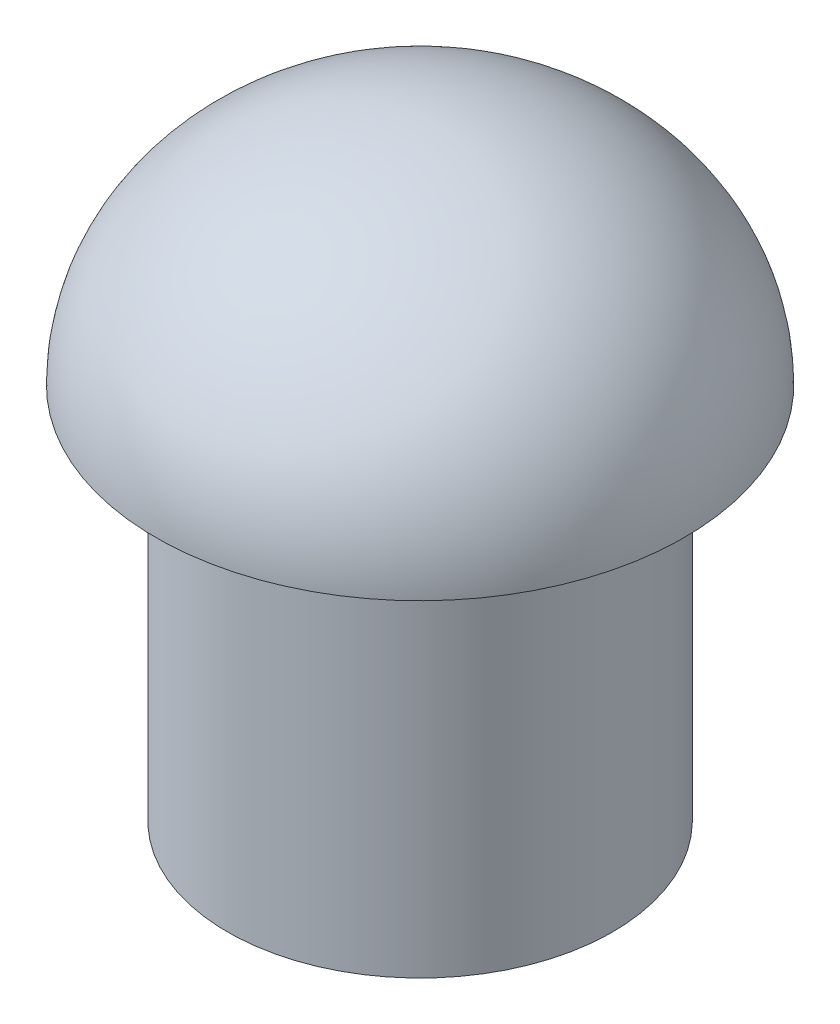
ISO-10303-21;
HEADER;
FILE_DESCRIPTION(('STEP AP214'),'2;1');
FILE_NAME('part.step','',(''),(''),'','','');
FILE_SCHEMA(('AUTOMOTIVE_DESIGN { 1 0 10303 214 1 1 1 1 }'));
ENDSEC;
DATA;
#1=APPLICATION_CONTEXT('core data for automotive mechanical design processes');
#2=APPLICATION_PROTOCOL_DEFINITION('international standard','automotive_design',2000,#1);
#3=PRODUCT_CONTEXT('',#1,'mechanical');
#4=PRODUCT('Part','Part','',(#3));
#5=PRODUCT_RELATED_PRODUCT_CATEGORY('part','',(#4));
#6=PRODUCT_DEFINITION_FORMATION('','',#4);
#7=PRODUCT_DEFINITION_CONTEXT('part definition',#1,'design');
#8=PRODUCT_DEFINITION('design','',#6,#7);
#9=PRODUCT_DEFINITION_SHAPE('','',#8);
#10=(LENGTH_UNIT() NAMED_UNIT(*) SI_UNIT(.MILLI.,.METRE.));
#11=(NAMED_UNIT(*) PLANE_ANGLE_UNIT() SI_UNIT($,.RADIAN.));
#12=(NAMED_UNIT(*) SI_UNIT($,.STERADIAN.) SOLID_ANGLE_UNIT());
#13=UNCERTAINTY_MEASURE_WITH_UNIT(LENGTH_MEASURE(1.E-05),#10,'distance_accuracy_value','');
#14=(GEOMETRIC_REPRESENTATION_CONTEXT(3) GLOBAL_UNCERTAINTY_ASSIGNED_CONTEXT((#13)) GLOBAL_UNIT_ASSIGNED_CONTEXT((#10,
#11,#12)) REPRESENTATION_CONTEXT('',''));
#15=CARTESIAN_POINT('',(0.,0.,0.));
#16=DIRECTION('',(0.,0.,1.));
#17=DIRECTION('',(1.,0.,0.));
#18=AXIS2_PLACEMENT_3D('',#15,#16,#17);
#19=CARTESIAN_POINT('',(0.,0.,0.));
#20=DIRECTION('',(0.,-1.,0.));
#21=DIRECTION('',(0.,0.,-1.));
#22=AXIS2_PLACEMENT_3D('',#19,#20,#21);
#23=PLANE('',#22);
#24=CARTESIAN_POINT('',(0.,0.,0.));
#25=DIRECTION('',(0.,-1.,0.));
#26=DIRECTION('',(0.,0.,-1.));
#27=AXIS2_PLACEMENT_3D('',#24,#25,#26);
#28=CIRCLE('',#27,2.55);
#29=CARTESIAN_POINT('',(0.,0.,-2.55));
#30=VERTEX_POINT('',#29);
#31=EDGE_CURVE('E116',#30,#30,#28,.T.);
#32=ORIENTED_EDGE('',*,*,#31,.F.);
#33=EDGE_LOOP('',(#32));
#34=FACE_BOUND('',#33,.T.);
#35=CARTESIAN_POINT('',(0.,0.,0.));
#36=DIRECTION('',(0.,-1.,0.));
#37=DIRECTION('',(0.,0.,-1.));
#38=AXIS2_PLACEMENT_3D('',#35,#36,#37);
#39=CIRCLE('',#38,3.5);
#40=CARTESIAN_POINT('',(0.,0.,-3.5));
#41=VERTEX_POINT('',#40);
#42=EDGE_CURVE('E11',#41,#41,#39,.T.);
#43=ORIENTED_EDGE('',*,*,#42,.T.);
#44=EDGE_LOOP('',(#43));
#45=FACE_BOUND('',#44,.T.);
#46=ADVANCED_FACE('F41',(#34,#45),#23,.T.);
#47=CARTESIAN_POINT('',(0.,0.,0.));
#48=DIRECTION('',(1.,0.,0.));
#49=DIRECTION('',(0.,0.,1.));
#50=AXIS2_PLACEMENT_3D('',#47,#48,#49);
#51=ELLIPSE('',#50,3.5,3.);
#52=TRIMMED_CURVE('',#51,(PARAMETER_VALUE(1.5707963267949)),(PARAMETER_VALUE(4.71238898038469)),
.T.,.PARAMETER.);
#53=CARTESIAN_POINT('',(0.,0.,0.));
#54=DIRECTION('',(0.,-1.,0.));
#55=AXIS1_PLACEMENT('',#53,#54);
#56=SURFACE_OF_REVOLUTION('',#52,#55);
#57=CARTESIAN_POINT('',(0.,3.,0.));
#58=VERTEX_POINT('',#57);
#59=VERTEX_LOOP('',#58);
#60=FACE_BOUND('',#59,.T.);
#61=ORIENTED_EDGE('',*,*,#42,.F.);
#62=EDGE_LOOP('',(#61));
#63=FACE_BOUND('',#62,.T.);
#64=ADVANCED_FACE('F124',(#60,#63),#56,.F.);
#65=CARTESIAN_POINT('',(0.,-5.,0.));
#66=DIRECTION('',(0.,1.,0.));
#67=DIRECTION('',(0.,0.,1.));
#68=AXIS2_PLACEMENT_3D('',#65,#66,#67);
#69=CYLINDRICAL_SURFACE('',#68,2.55);
#70=CARTESIAN_POINT('',(0.,-5.,0.));
#71=DIRECTION('',(0.,-1.,0.));
#72=DIRECTION('',(0.,0.,-1.));
#73=AXIS2_PLACEMENT_3D('',#70,#71,#72);
#74=CIRCLE('',#73,2.55);
#75=CARTESIAN_POINT('',(0.,-5.,-2.55));
#76=VERTEX_POINT('',#75);
#77=EDGE_CURVE('E48',#76,#76,#74,.T.);
#78=ORIENTED_EDGE('',*,*,#77,.F.);
#79=EDGE_LOOP('',(#78));
#80=FACE_BOUND('',#79,.T.);
#81=ORIENTED_EDGE('',*,*,#31,.T.);
#82=EDGE_LOOP('',(#81));
#83=FACE_BOUND('',#82,.T.);
#84=ADVANCED_FACE('F127',(#80,#83),#69,.T.);
#85=CARTESIAN_POINT('',(0.,-5.,0.));
#86=DIRECTION('',(0.,-1.,0.));
#87=DIRECTION('',(0.,0.,-1.));
#88=AXIS2_PLACEMENT_3D('',#85,#86,#87);
#89=PLANE('',#88);
#90=DIRECTION('',(0.,0.,1.));
#91=VECTOR('',#90,1.);
#92=CARTESIAN_POINT('',(1.55,-5.,-1.55));
#93=LINE('',#92,#91);
#94=CARTESIAN_POINT('',(1.55,-5.,-1.55));
#95=VERTEX_POINT('',#94);
#96=CARTESIAN_POINT('',(1.55,-5.,1.55));
#97=VERTEX_POINT('',#96);
#98=EDGE_CURVE('E55',#95,#97,#93,.T.);
#99=ORIENTED_EDGE('',*,*,#98,.F.);
#100=DIRECTION('',(1.,0.,0.));
#101=VECTOR('',#100,1.);
#102=CARTESIAN_POINT('',(-1.55,-5.,-1.55));
#103=LINE('',#102,#101);
#104=CARTESIAN_POINT('',(-1.55,-5.,-1.55));
#105=VERTEX_POINT('',#104);
#106=EDGE_CURVE('E101',#105,#95,#103,.T.);
#107=ORIENTED_EDGE('',*,*,#106,.F.);
#108=DIRECTION('',(0.,0.,-1.));
#109=VECTOR('',#108,1.);
#110=CARTESIAN_POINT('',(-1.55,-5.,-1.55));
#111=LINE('',#110,#109);
#112=CARTESIAN_POINT('',(-1.55,-5.,1.55));
#113=VERTEX_POINT('',#112);
#114=EDGE_CURVE('E104',#113,#105,#111,.T.);
#115=ORIENTED_EDGE('',*,*,#114,.F.);
#116=DIRECTION('',(-1.,0.,0.));
#117=VECTOR('',#116,1.);
#118=CARTESIAN_POINT('',(-1.55,-5.,1.55));
#119=LINE('',#118,#117);
#120=EDGE_CURVE('E110',#97,#113,#119,.T.);
#121=ORIENTED_EDGE('',*,*,#120,.F.);
#122=EDGE_LOOP('',(#99,#107,#115,#121));
#123=FACE_BOUND('',#122,.T.);
#124=ORIENTED_EDGE('',*,*,#77,.T.);
#125=EDGE_LOOP('',(#124));
#126=FACE_BOUND('',#125,.T.);
#127=ADVANCED_FACE('F130',(#123,#126),#89,.T.);
#128=CARTESIAN_POINT('',(1.55,-3.,-1.55));
#129=DIRECTION('',(1.,0.,0.));
#130=DIRECTION('',(0.,0.,-1.));
#131=AXIS2_PLACEMENT_3D('',#128,#129,#130);
#132=PLANE('',#131);
#133=ORIENTED_EDGE('',*,*,#98,.T.);
#134=DIRECTION('',(0.,-1.,0.));
#135=VECTOR('',#134,1.);
#136=CARTESIAN_POINT('',(1.55,-3.,1.55));
#137=LINE('',#136,#135);
#138=CARTESIAN_POINT('',(1.55,-3.,1.55));
#139=VERTEX_POINT('',#138);
#140=EDGE_CURVE('E79',#139,#97,#137,.T.);
#141=ORIENTED_EDGE('',*,*,#140,.F.);
#142=DIRECTION('',(0.,0.,1.));
#143=VECTOR('',#142,1.);
#144=CARTESIAN_POINT('',(1.55,-3.,-1.55));
#145=LINE('',#144,#143);
#146=CARTESIAN_POINT('',(1.55,-3.,-1.55));
#147=VERTEX_POINT('',#146);
#148=EDGE_CURVE('E83',#147,#139,#145,.T.);
#149=ORIENTED_EDGE('',*,*,#148,.F.);
#150=DIRECTION('',(0.,-1.,0.));
#151=VECTOR('',#150,1.);
#152=CARTESIAN_POINT('',(1.55,-3.,-1.55));
#153=LINE('',#152,#151);
#154=EDGE_CURVE('E114',#147,#95,#153,.T.);
#155=ORIENTED_EDGE('',*,*,#154,.T.);
#156=EDGE_LOOP('',(#133,#141,#149,#155));
#157=FACE_BOUND('',#156,.T.);
#158=ADVANCED_FACE('F81',(#157),#132,.F.);
#159=CARTESIAN_POINT('',(-1.55,-3.,-1.55));
#160=DIRECTION('',(0.,0.,-1.));
#161=DIRECTION('',(-1.,0.,0.));
#162=AXIS2_PLACEMENT_3D('',#159,#160,#161);
#163=PLANE('',#162);
#164=ORIENTED_EDGE('',*,*,#106,.T.);
#165=ORIENTED_EDGE('',*,*,#154,.F.);
#166=DIRECTION('',(1.,0.,0.));
#167=VECTOR('',#166,1.);
#168=CARTESIAN_POINT('',(-1.55,-3.,-1.55));
#169=LINE('',#168,#167);
#170=CARTESIAN_POINT('',(-1.55,-3.,-1.55));
#171=VERTEX_POINT('',#170);
#172=EDGE_CURVE('E89',#171,#147,#169,.T.);
#173=ORIENTED_EDGE('',*,*,#172,.F.);
#174=DIRECTION('',(0.,-1.,0.));
#175=VECTOR('',#174,1.);
#176=CARTESIAN_POINT('',(-1.55,-3.,-1.55));
#177=LINE('',#176,#175);
#178=EDGE_CURVE('E117',#171,#105,#177,.T.);
#179=ORIENTED_EDGE('',*,*,#178,.T.);
#180=EDGE_LOOP('',(#164,#165,#173,#179));
#181=FACE_BOUND('',#180,.T.);
#182=ADVANCED_FACE('F137',(#181),#163,.F.);
#183=CARTESIAN_POINT('',(-1.55,-3.,-1.55));
#184=DIRECTION('',(-1.,0.,0.));
#185=DIRECTION('',(0.,0.,1.));
#186=AXIS2_PLACEMENT_3D('',#183,#184,#185);
#187=PLANE('',#186);
#188=ORIENTED_EDGE('',*,*,#114,.T.);
#189=ORIENTED_EDGE('',*,*,#178,.F.);
#190=DIRECTION('',(0.,0.,-1.));
#191=VECTOR('',#190,1.);
#192=CARTESIAN_POINT('',(-1.55,-3.,-1.55));
#193=LINE('',#192,#191);
#194=CARTESIAN_POINT('',(-1.55,-3.,1.55));
#195=VERTEX_POINT('',#194);
#196=EDGE_CURVE('E97',#195,#171,#193,.T.);
#197=ORIENTED_EDGE('',*,*,#196,.F.);
#198=DIRECTION('',(0.,-1.,0.));
#199=VECTOR('',#198,1.);
#200=CARTESIAN_POINT('',(-1.55,-3.,1.55));
#201=LINE('',#200,#199);
#202=EDGE_CURVE('E88',#195,#113,#201,.T.);
#203=ORIENTED_EDGE('',*,*,#202,.T.);
#204=EDGE_LOOP('',(#188,#189,#197,#203));
#205=FACE_BOUND('',#204,.T.);
#206=ADVANCED_FACE('F140',(#205),#187,.F.);
#207=CARTESIAN_POINT('',(-1.55,-3.,1.55));
#208=DIRECTION('',(0.,0.,1.));
#209=DIRECTION('',(1.,0.,0.));
#210=AXIS2_PLACEMENT_3D('',#207,#208,#209);
#211=PLANE('',#210);
#212=ORIENTED_EDGE('',*,*,#120,.T.);
#213=ORIENTED_EDGE('',*,*,#202,.F.);
#214=DIRECTION('',(-1.,0.,0.));
#215=VECTOR('',#214,1.);
#216=CARTESIAN_POINT('',(-1.55,-3.,1.55));
#217=LINE('',#216,#215);
#218=EDGE_CURVE('E92',#139,#195,#217,.T.);
#219=ORIENTED_EDGE('',*,*,#218,.F.);
#220=ORIENTED_EDGE('',*,*,#140,.T.);
#221=EDGE_LOOP('',(#212,#213,#219,#220));
#222=FACE_BOUND('',#221,.T.);
#223=ADVANCED_FACE('F93',(#222),#211,.F.);
#224=CARTESIAN_POINT('',(0.,-3.,0.));
#225=DIRECTION('',(0.,1.,0.));
#226=DIRECTION('',(0.,0.,1.));
#227=AXIS2_PLACEMENT_3D('',#224,#225,#226);
#228=PLANE('',#227);
#229=ORIENTED_EDGE('',*,*,#148,.T.);
#230=ORIENTED_EDGE('',*,*,#218,.T.);
#231=ORIENTED_EDGE('',*,*,#196,.T.);
#232=ORIENTED_EDGE('',*,*,#172,.T.);
#233=EDGE_LOOP('',(#229,#230,#231,#232));
#234=FACE_BOUND('',#233,.T.);
#235=ADVANCED_FACE('F99',(#234),#228,.F.);
#236=CLOSED_SHELL('',(#46,#64,#84,#127,#158,#182,#206,#223,#235));
#237=MANIFOLD_SOLID_BREP('B2',#236);
#238=ADVANCED_BREP_SHAPE_REPRESENTATION('',(#18,#237),#14);
#239=SHAPE_DEFINITION_REPRESENTATION(#9,#238);
ENDSEC;
END-ISO-10303-21;
